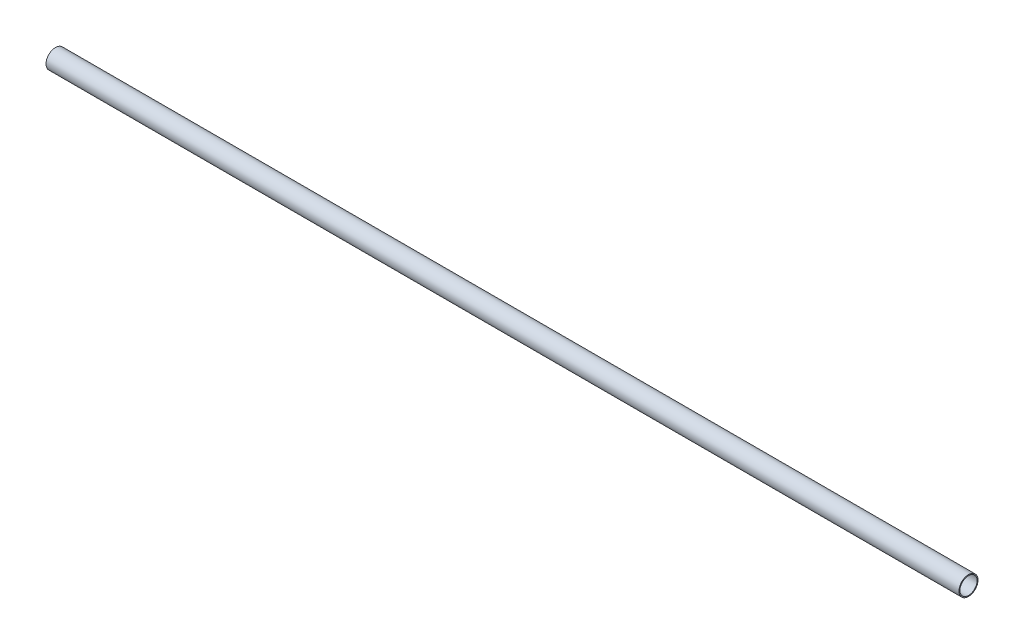
ISO-10303-21;
HEADER;
FILE_DESCRIPTION(('STEP AP214'),'2;1');
FILE_NAME('part.step','',(''),(''),'','','');
FILE_SCHEMA(('AUTOMOTIVE_DESIGN { 1 0 10303 214 1 1 1 1 }'));
ENDSEC;
DATA;
#1=APPLICATION_CONTEXT('core data for automotive mechanical design processes');
#2=APPLICATION_PROTOCOL_DEFINITION('international standard','automotive_design',2000,#1);
#3=PRODUCT_CONTEXT('',#1,'mechanical');
#4=PRODUCT('Part','Part','',(#3));
#5=PRODUCT_RELATED_PRODUCT_CATEGORY('part','',(#4));
#6=PRODUCT_DEFINITION_FORMATION('','',#4);
#7=PRODUCT_DEFINITION_CONTEXT('part definition',#1,'design');
#8=PRODUCT_DEFINITION('design','',#6,#7);
#9=PRODUCT_DEFINITION_SHAPE('','',#8);
#10=(LENGTH_UNIT() NAMED_UNIT(*) SI_UNIT(.MILLI.,.METRE.));
#11=(NAMED_UNIT(*) PLANE_ANGLE_UNIT() SI_UNIT($,.RADIAN.));
#12=(NAMED_UNIT(*) SI_UNIT($,.STERADIAN.) SOLID_ANGLE_UNIT());
#13=UNCERTAINTY_MEASURE_WITH_UNIT(LENGTH_MEASURE(1.E-05),#10,'distance_accuracy_value','');
#14=(GEOMETRIC_REPRESENTATION_CONTEXT(3) GLOBAL_UNCERTAINTY_ASSIGNED_CONTEXT((#13)) GLOBAL_UNIT_ASSIGNED_CONTEXT((#10,
#11,#12)) REPRESENTATION_CONTEXT('',''));
#15=CARTESIAN_POINT('',(0.,0.,0.));
#16=DIRECTION('',(0.,0.,1.));
#17=DIRECTION('',(1.,0.,0.));
#18=AXIS2_PLACEMENT_3D('',#15,#16,#17);
#19=CARTESIAN_POINT('',(762.,0.,0.));
#20=DIRECTION('',(-1.,0.,0.));
#21=DIRECTION('',(0.,0.,1.));
#22=AXIS2_PLACEMENT_3D('',#19,#20,#21);
#23=CYLINDRICAL_SURFACE('',#22,14.2875);
#24=CARTESIAN_POINT('',(-762.,0.,0.));
#25=DIRECTION('',(-1.,0.,0.));
#26=DIRECTION('',(0.,0.,1.));
#27=AXIS2_PLACEMENT_3D('',#24,#25,#26);
#28=CIRCLE('',#27,14.2875);
#29=CARTESIAN_POINT('',(-762.,0.,14.2875));
#30=VERTEX_POINT('',#29);
#31=EDGE_CURVE('E26',#30,#30,#28,.T.);
#32=ORIENTED_EDGE('',*,*,#31,.T.);
#33=EDGE_LOOP('',(#32));
#34=FACE_BOUND('',#33,.T.);
#35=CARTESIAN_POINT('',(762.,0.,0.));
#36=DIRECTION('',(-1.,0.,0.));
#37=DIRECTION('',(0.,0.,1.));
#38=AXIS2_PLACEMENT_3D('',#35,#36,#37);
#39=CIRCLE('',#38,14.2875);
#40=CARTESIAN_POINT('',(762.,0.,14.2875));
#41=VERTEX_POINT('',#40);
#42=EDGE_CURVE('E17',#41,#41,#39,.T.);
#43=ORIENTED_EDGE('',*,*,#42,.F.);
#44=EDGE_LOOP('',(#43));
#45=FACE_BOUND('',#44,.T.);
#46=ADVANCED_FACE('F14',(#34,#45),#23,.F.);
#47=CARTESIAN_POINT('',(762.,0.,0.));
#48=DIRECTION('',(1.,0.,0.));
#49=DIRECTION('',(0.,0.,-1.));
#50=AXIS2_PLACEMENT_3D('',#47,#48,#49);
#51=PLANE('',#50);
#52=ORIENTED_EDGE('',*,*,#42,.T.);
#53=EDGE_LOOP('',(#52));
#54=FACE_BOUND('',#53,.T.);
#55=CARTESIAN_POINT('',(762.,0.,0.));
#56=DIRECTION('',(-1.,0.,0.));
#57=DIRECTION('',(0.,0.,1.));
#58=AXIS2_PLACEMENT_3D('',#55,#56,#57);
#59=CIRCLE('',#58,15.875);
#60=CARTESIAN_POINT('',(762.,0.,15.875));
#61=VERTEX_POINT('',#60);
#62=EDGE_CURVE('E21',#61,#61,#59,.T.);
#63=ORIENTED_EDGE('',*,*,#62,.F.);
#64=EDGE_LOOP('',(#63));
#65=FACE_BOUND('',#64,.T.);
#66=ADVANCED_FACE('F34',(#54,#65),#51,.T.);
#67=CARTESIAN_POINT('',(-762.,0.,0.));
#68=DIRECTION('',(1.,0.,0.));
#69=DIRECTION('',(0.,0.,-1.));
#70=AXIS2_PLACEMENT_3D('',#67,#68,#69);
#71=PLANE('',#70);
#72=ORIENTED_EDGE('',*,*,#31,.F.);
#73=EDGE_LOOP('',(#72));
#74=FACE_BOUND('',#73,.T.);
#75=CARTESIAN_POINT('',(-762.,0.,0.));
#76=DIRECTION('',(-1.,0.,0.));
#77=DIRECTION('',(0.,0.,1.));
#78=AXIS2_PLACEMENT_3D('',#75,#76,#77);
#79=CIRCLE('',#78,15.875);
#80=CARTESIAN_POINT('',(-762.,0.,15.875));
#81=VERTEX_POINT('',#80);
#82=EDGE_CURVE('E8',#81,#81,#79,.F.);
#83=ORIENTED_EDGE('',*,*,#82,.F.);
#84=EDGE_LOOP('',(#83));
#85=FACE_BOUND('',#84,.T.);
#86=ADVANCED_FACE('F41',(#74,#85),#71,.F.);
#87=CARTESIAN_POINT('',(762.,0.,0.));
#88=DIRECTION('',(-1.,0.,0.));
#89=DIRECTION('',(0.,0.,1.));
#90=AXIS2_PLACEMENT_3D('',#87,#88,#89);
#91=CYLINDRICAL_SURFACE('',#90,15.875);
#92=ORIENTED_EDGE('',*,*,#82,.T.);
#93=EDGE_LOOP('',(#92));
#94=FACE_BOUND('',#93,.T.);
#95=ORIENTED_EDGE('',*,*,#62,.T.);
#96=EDGE_LOOP('',(#95));
#97=FACE_BOUND('',#96,.T.);
#98=ADVANCED_FACE('F42',(#94,#97),#91,.T.);
#99=CLOSED_SHELL('',(#46,#66,#86,#98));
#100=MANIFOLD_SOLID_BREP('B1',#99);
#101=ADVANCED_BREP_SHAPE_REPRESENTATION('',(#18,#100),#14);
#102=SHAPE_DEFINITION_REPRESENTATION(#9,#101);
ENDSEC;
END-ISO-10303-21;
